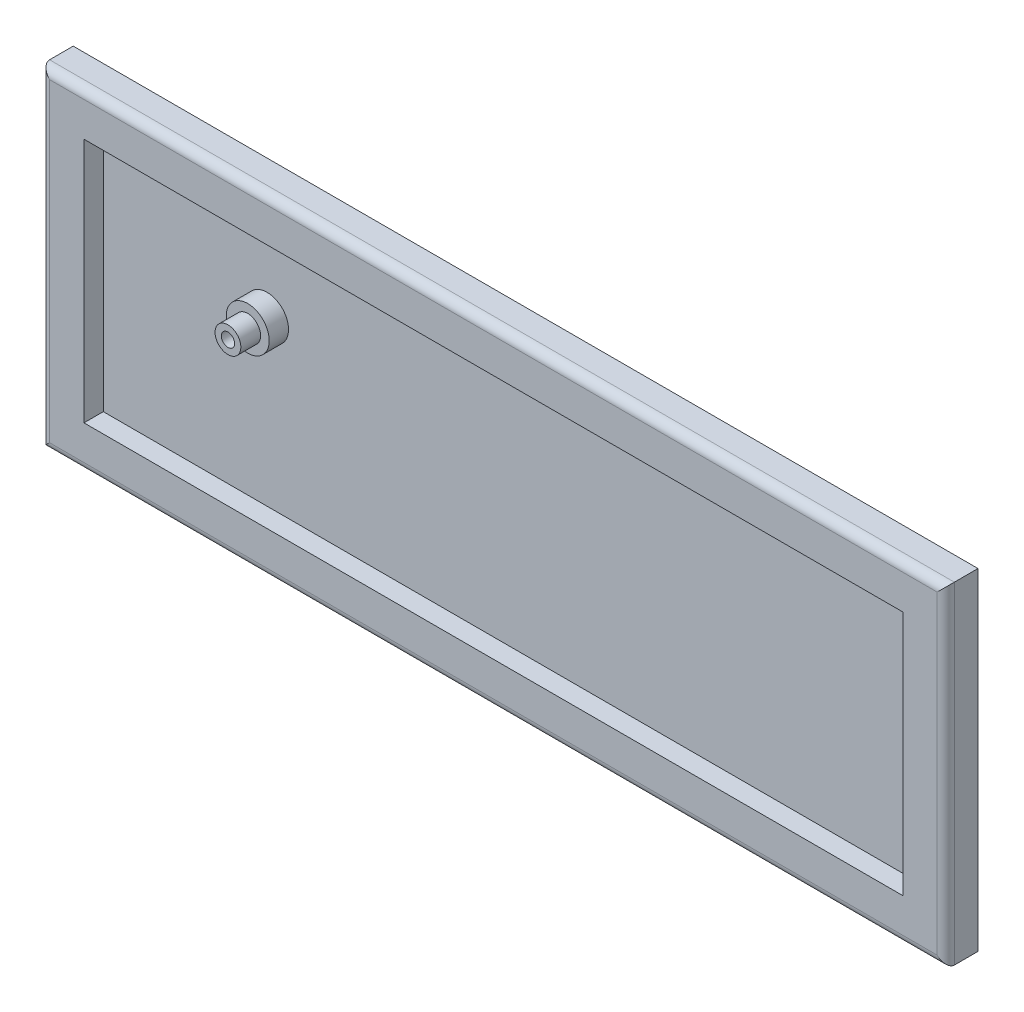
ISO-10303-21;
HEADER;
FILE_DESCRIPTION(('STEP AP214'),'2;1');
FILE_NAME('part.step','',(''),(''),'','','');
FILE_SCHEMA(('AUTOMOTIVE_DESIGN { 1 0 10303 214 1 1 1 1 }'));
ENDSEC;
DATA;
#1=APPLICATION_CONTEXT('core data for automotive mechanical design processes');
#2=APPLICATION_PROTOCOL_DEFINITION('international standard','automotive_design',2000,#1);
#3=PRODUCT_CONTEXT('',#1,'mechanical');
#4=PRODUCT('Part','Part','',(#3));
#5=PRODUCT_RELATED_PRODUCT_CATEGORY('part','',(#4));
#6=PRODUCT_DEFINITION_FORMATION('','',#4);
#7=PRODUCT_DEFINITION_CONTEXT('part definition',#1,'design');
#8=PRODUCT_DEFINITION('design','',#6,#7);
#9=PRODUCT_DEFINITION_SHAPE('','',#8);
#10=(LENGTH_UNIT() NAMED_UNIT(*) SI_UNIT(.MILLI.,.METRE.));
#11=(NAMED_UNIT(*) PLANE_ANGLE_UNIT() SI_UNIT($,.RADIAN.));
#12=(NAMED_UNIT(*) SI_UNIT($,.STERADIAN.) SOLID_ANGLE_UNIT());
#13=UNCERTAINTY_MEASURE_WITH_UNIT(LENGTH_MEASURE(1.E-05),#10,'distance_accuracy_value','');
#14=(GEOMETRIC_REPRESENTATION_CONTEXT(3) GLOBAL_UNCERTAINTY_ASSIGNED_CONTEXT((#13)) GLOBAL_UNIT_ASSIGNED_CONTEXT((#10,
#11,#12)) REPRESENTATION_CONTEXT('',''));
#15=CARTESIAN_POINT('',(0.,0.,0.));
#16=DIRECTION('',(0.,0.,1.));
#17=DIRECTION('',(1.,0.,0.));
#18=AXIS2_PLACEMENT_3D('',#15,#16,#17);
#19=CARTESIAN_POINT('',(-9.90490769999997,-9.74318500000001,34.5));
#20=DIRECTION('',(1.,0.,0.));
#21=DIRECTION('',(0.,0.,-1.));
#22=AXIS2_PLACEMENT_3D('',#19,#20,#21);
#23=PLANE('',#22);
#24=DIRECTION('',(0.,0.,-1.));
#25=VECTOR('',#24,1.);
#26=CARTESIAN_POINT('',(-9.90490769999997,-9.74318500000001,34.5));
#27=LINE('',#26,#25);
#28=CARTESIAN_POINT('',(-9.90490769999997,-9.74318500000001,5.50000000000001));
#29=VERTEX_POINT('',#28);
#30=CARTESIAN_POINT('',(-9.90490769999997,-9.74318500000001,0.));
#31=VERTEX_POINT('',#30);
#32=EDGE_CURVE('E204',#29,#31,#27,.T.);
#33=ORIENTED_EDGE('',*,*,#32,.F.);
#34=DIRECTION('',(0.,-1.,0.));
#35=VECTOR('',#34,1.);
#36=CARTESIAN_POINT('',(-9.90490769999997,67.407315,5.5));
#37=LINE('',#36,#35);
#38=CARTESIAN_POINT('',(-9.90490769999997,67.407315,5.50000000000001));
#39=VERTEX_POINT('',#38);
#40=EDGE_CURVE('E12',#29,#39,#37,.F.);
#41=ORIENTED_EDGE('',*,*,#40,.T.);
#42=DIRECTION('',(0.,0.,-1.));
#43=VECTOR('',#42,1.);
#44=CARTESIAN_POINT('',(-9.90490769999997,67.407315,34.5));
#45=LINE('',#44,#43);
#46=CARTESIAN_POINT('',(-9.90490769999997,67.407315,0.));
#47=VERTEX_POINT('',#46);
#48=EDGE_CURVE('E192',#39,#47,#45,.T.);
#49=ORIENTED_EDGE('',*,*,#48,.T.);
#50=DIRECTION('',(0.,-1.,0.));
#51=VECTOR('',#50,1.);
#52=CARTESIAN_POINT('',(-9.90490769999997,-9.74318500000001,0.));
#53=LINE('',#52,#51);
#54=EDGE_CURVE('E197',#47,#31,#53,.T.);
#55=ORIENTED_EDGE('',*,*,#54,.T.);
#56=EDGE_LOOP('',(#33,#41,#49,#55));
#57=FACE_BOUND('',#56,.T.);
#58=ADVANCED_FACE('F42',(#57),#23,.F.);
#59=CARTESIAN_POINT('',(200.5959923,-9.74318499999999,34.5));
#60=DIRECTION('',(0.,1.,0.));
#61=DIRECTION('',(-1.,0.,0.));
#62=AXIS2_PLACEMENT_3D('',#59,#60,#61);
#63=PLANE('',#62);
#64=DIRECTION('',(0.,0.,-1.));
#65=VECTOR('',#64,1.);
#66=CARTESIAN_POINT('',(200.5959923,-9.74318499999999,34.5));
#67=LINE('',#66,#65);
#68=CARTESIAN_POINT('',(200.5959923,-9.74318499999999,5.50000000000001));
#69=VERTEX_POINT('',#68);
#70=CARTESIAN_POINT('',(200.5959923,-9.74318499999999,0.));
#71=VERTEX_POINT('',#70);
#72=EDGE_CURVE('E234',#69,#71,#67,.T.);
#73=ORIENTED_EDGE('',*,*,#72,.F.);
#74=DIRECTION('',(1.,0.,0.));
#75=VECTOR('',#74,1.);
#76=CARTESIAN_POINT('',(-9.90490769999997,-9.74318500000001,5.5));
#77=LINE('',#76,#75);
#78=EDGE_CURVE('E52',#69,#29,#77,.F.);
#79=ORIENTED_EDGE('',*,*,#78,.T.);
#80=ORIENTED_EDGE('',*,*,#32,.T.);
#81=DIRECTION('',(1.,0.,0.));
#82=VECTOR('',#81,1.);
#83=CARTESIAN_POINT('',(200.5959923,-9.74318499999999,0.));
#84=LINE('',#83,#82);
#85=EDGE_CURVE('E233',#31,#71,#84,.T.);
#86=ORIENTED_EDGE('',*,*,#85,.T.);
#87=EDGE_LOOP('',(#73,#79,#80,#86));
#88=FACE_BOUND('',#87,.T.);
#89=ADVANCED_FACE('F305',(#88),#63,.F.);
#90=CARTESIAN_POINT('',(200.5959923,-9.74318499999999,34.5));
#91=DIRECTION('',(-1.,0.,0.));
#92=DIRECTION('',(0.,0.,1.));
#93=AXIS2_PLACEMENT_3D('',#90,#91,#92);
#94=PLANE('',#93);
#95=DIRECTION('',(0.,0.,-1.));
#96=VECTOR('',#95,1.);
#97=CARTESIAN_POINT('',(200.5959923,67.407315,34.5));
#98=LINE('',#97,#96);
#99=CARTESIAN_POINT('',(200.5959923,67.407315,5.50000000000001));
#100=VERTEX_POINT('',#99);
#101=CARTESIAN_POINT('',(200.5959923,67.407315,0.));
#102=VERTEX_POINT('',#101);
#103=EDGE_CURVE('E208',#100,#102,#98,.T.);
#104=ORIENTED_EDGE('',*,*,#103,.F.);
#105=DIRECTION('',(0.,1.,0.));
#106=VECTOR('',#105,1.);
#107=CARTESIAN_POINT('',(200.5959923,-9.74318499999999,5.5));
#108=LINE('',#107,#106);
#109=EDGE_CURVE('E67',#100,#69,#108,.F.);
#110=ORIENTED_EDGE('',*,*,#109,.T.);
#111=ORIENTED_EDGE('',*,*,#72,.T.);
#112=DIRECTION('',(0.,1.,0.));
#113=VECTOR('',#112,1.);
#114=CARTESIAN_POINT('',(200.5959923,-9.74318499999999,0.));
#115=LINE('',#114,#113);
#116=EDGE_CURVE('E236',#71,#102,#115,.T.);
#117=ORIENTED_EDGE('',*,*,#116,.T.);
#118=EDGE_LOOP('',(#104,#110,#111,#117));
#119=FACE_BOUND('',#118,.T.);
#120=ADVANCED_FACE('F286',(#119),#94,.F.);
#121=CARTESIAN_POINT('',(200.5959923,67.407315,34.5));
#122=DIRECTION('',(0.,-1.,0.));
#123=DIRECTION('',(1.,0.,0.));
#124=AXIS2_PLACEMENT_3D('',#121,#122,#123);
#125=PLANE('',#124);
#126=ORIENTED_EDGE('',*,*,#48,.F.);
#127=DIRECTION('',(-1.,0.,0.));
#128=VECTOR('',#127,1.);
#129=CARTESIAN_POINT('',(200.5959923,67.407315,5.5));
#130=LINE('',#129,#128);
#131=EDGE_CURVE('E170',#39,#100,#130,.F.);
#132=ORIENTED_EDGE('',*,*,#131,.T.);
#133=ORIENTED_EDGE('',*,*,#103,.T.);
#134=DIRECTION('',(-1.,0.,0.));
#135=VECTOR('',#134,1.);
#136=CARTESIAN_POINT('',(200.5959923,67.407315,0.));
#137=LINE('',#136,#135);
#138=EDGE_CURVE('E226',#102,#47,#137,.T.);
#139=ORIENTED_EDGE('',*,*,#138,.T.);
#140=EDGE_LOOP('',(#126,#132,#133,#139));
#141=FACE_BOUND('',#140,.T.);
#142=ADVANCED_FACE('F284',(#141),#125,.F.);
#143=CARTESIAN_POINT('',(38.19575,38.357,12.1));
#144=DIRECTION('',(0.,0.,1.));
#145=DIRECTION('',(1.,0.,0.));
#146=AXIS2_PLACEMENT_3D('',#143,#144,#145);
#147=PLANE('',#146);
#148=CARTESIAN_POINT('',(38.19575,38.357,12.1));
#149=DIRECTION('',(0.,0.,1.));
#150=DIRECTION('',(1.,0.,0.));
#151=AXIS2_PLACEMENT_3D('',#148,#149,#150);
#152=CIRCLE('',#151,1.55);
#153=CARTESIAN_POINT('',(39.74575,38.357,12.1));
#154=VERTEX_POINT('',#153);
#155=EDGE_CURVE('E231',#154,#154,#152,.T.);
#156=ORIENTED_EDGE('',*,*,#155,.F.);
#157=EDGE_LOOP('',(#156));
#158=FACE_BOUND('',#157,.T.);
#159=CARTESIAN_POINT('',(38.19575,38.357,12.1));
#160=DIRECTION('',(0.,0.,1.));
#161=DIRECTION('',(1.,0.,0.));
#162=AXIS2_PLACEMENT_3D('',#159,#160,#161);
#163=CIRCLE('',#162,3.);
#164=CARTESIAN_POINT('',(41.19575,38.357,12.1));
#165=VERTEX_POINT('',#164);
#166=EDGE_CURVE('E221',#165,#165,#163,.T.);
#167=ORIENTED_EDGE('',*,*,#166,.T.);
#168=EDGE_LOOP('',(#167));
#169=FACE_BOUND('',#168,.T.);
#170=ADVANCED_FACE('F364',(#158,#169),#147,.T.);
#171=CARTESIAN_POINT('',(0.,0.,0.));
#172=DIRECTION('',(0.,0.,1.));
#173=DIRECTION('',(1.,0.,0.));
#174=AXIS2_PLACEMENT_3D('',#171,#172,#173);
#175=PLANE('',#174);
#176=CARTESIAN_POINT('',(38.19575,38.357,0.));
#177=DIRECTION('',(0.,0.,1.));
#178=DIRECTION('',(1.,0.,0.));
#179=AXIS2_PLACEMENT_3D('',#176,#177,#178);
#180=CIRCLE('',#179,2.1);
#181=CARTESIAN_POINT('',(36.09575,38.357,0.));
#182=VERTEX_POINT('',#181);
#183=EDGE_CURVE('E225',#182,#182,#180,.T.);
#184=ORIENTED_EDGE('',*,*,#183,.T.);
#185=EDGE_LOOP('',(#184));
#186=FACE_BOUND('',#185,.T.);
#187=ORIENTED_EDGE('',*,*,#54,.F.);
#188=ORIENTED_EDGE('',*,*,#138,.F.);
#189=ORIENTED_EDGE('',*,*,#116,.F.);
#190=ORIENTED_EDGE('',*,*,#85,.F.);
#191=EDGE_LOOP('',(#187,#188,#189,#190));
#192=FACE_BOUND('',#191,.T.);
#193=ADVANCED_FACE('F288',(#186,#192),#175,.F.);
#194=CARTESIAN_POINT('',(38.19575,38.357,7.6));
#195=DIRECTION('',(0.,0.,-1.));
#196=DIRECTION('',(-1.,0.,0.));
#197=AXIS2_PLACEMENT_3D('',#194,#195,#196);
#198=CYLINDRICAL_SURFACE('',#197,2.1);
#199=CARTESIAN_POINT('',(38.19575,38.357,3.));
#200=DIRECTION('',(0.,0.,1.));
#201=DIRECTION('',(1.,0.,0.));
#202=AXIS2_PLACEMENT_3D('',#199,#200,#201);
#203=CIRCLE('',#202,2.1);
#204=CARTESIAN_POINT('',(36.09575,38.357,3.));
#205=VERTEX_POINT('',#204);
#206=EDGE_CURVE('E268',#205,#205,#203,.F.);
#207=CARTESIAN_POINT('',(36.09575,38.357,3.));
#208=CARTESIAN_POINT('',(36.09575,38.357,2.96875));
#209=CARTESIAN_POINT('',(36.09575,38.357,2.9375));
#210=CARTESIAN_POINT('',(36.09575,38.357,2.875));
#211=CARTESIAN_POINT('',(36.09575,38.357,2.84375));
#212=CARTESIAN_POINT('',(36.09575,38.357,2.78125));
#213=CARTESIAN_POINT('',(36.09575,38.357,2.75));
#214=CARTESIAN_POINT('',(36.09575,38.357,2.6875));
#215=CARTESIAN_POINT('',(36.09575,38.357,2.65625));
#216=CARTESIAN_POINT('',(36.09575,38.357,2.59375));
#217=CARTESIAN_POINT('',(36.09575,38.357,2.5625));
#218=CARTESIAN_POINT('',(36.09575,38.357,2.5));
#219=CARTESIAN_POINT('',(36.09575,38.357,2.46875));
#220=CARTESIAN_POINT('',(36.09575,38.357,2.40625));
#221=CARTESIAN_POINT('',(36.09575,38.357,2.375));
#222=CARTESIAN_POINT('',(36.09575,38.357,2.3125));
#223=CARTESIAN_POINT('',(36.09575,38.357,2.28125));
#224=CARTESIAN_POINT('',(36.09575,38.357,2.21875));
#225=CARTESIAN_POINT('',(36.09575,38.357,2.1875));
#226=CARTESIAN_POINT('',(36.09575,38.357,2.125));
#227=CARTESIAN_POINT('',(36.09575,38.357,2.09375));
#228=CARTESIAN_POINT('',(36.09575,38.357,2.03125));
#229=CARTESIAN_POINT('',(36.09575,38.357,2.));
#230=CARTESIAN_POINT('',(36.09575,38.357,1.9375));
#231=CARTESIAN_POINT('',(36.09575,38.357,1.90625));
#232=CARTESIAN_POINT('',(36.09575,38.357,1.84375));
#233=CARTESIAN_POINT('',(36.09575,38.357,1.8125));
#234=CARTESIAN_POINT('',(36.09575,38.357,1.75));
#235=CARTESIAN_POINT('',(36.09575,38.357,1.71875));
#236=CARTESIAN_POINT('',(36.09575,38.357,1.65625));
#237=CARTESIAN_POINT('',(36.09575,38.357,1.625));
#238=CARTESIAN_POINT('',(36.09575,38.357,1.5625));
#239=CARTESIAN_POINT('',(36.09575,38.357,1.53125));
#240=CARTESIAN_POINT('',(36.09575,38.357,1.46875));
#241=CARTESIAN_POINT('',(36.09575,38.357,1.4375));
#242=CARTESIAN_POINT('',(36.09575,38.357,1.375));
#243=CARTESIAN_POINT('',(36.09575,38.357,1.34375));
#244=CARTESIAN_POINT('',(36.09575,38.357,1.28125));
#245=CARTESIAN_POINT('',(36.09575,38.357,1.25));
#246=CARTESIAN_POINT('',(36.09575,38.357,1.1875));
#247=CARTESIAN_POINT('',(36.09575,38.357,1.15625));
#248=CARTESIAN_POINT('',(36.09575,38.357,1.09375));
#249=CARTESIAN_POINT('',(36.09575,38.357,1.0625));
#250=CARTESIAN_POINT('',(36.09575,38.357,0.999999999999999));
#251=CARTESIAN_POINT('',(36.09575,38.357,0.96875));
#252=CARTESIAN_POINT('',(36.09575,38.357,0.90625));
#253=CARTESIAN_POINT('',(36.09575,38.357,0.875));
#254=CARTESIAN_POINT('',(36.09575,38.357,0.8125));
#255=CARTESIAN_POINT('',(36.09575,38.357,0.78125));
#256=CARTESIAN_POINT('',(36.09575,38.357,0.71875));
#257=CARTESIAN_POINT('',(36.09575,38.357,0.6875));
#258=CARTESIAN_POINT('',(36.09575,38.357,0.625));
#259=CARTESIAN_POINT('',(36.09575,38.357,0.59375));
#260=CARTESIAN_POINT('',(36.09575,38.357,0.53125));
#261=CARTESIAN_POINT('',(36.09575,38.357,0.5));
#262=CARTESIAN_POINT('',(36.09575,38.357,0.4375));
#263=CARTESIAN_POINT('',(36.09575,38.357,0.40625));
#264=CARTESIAN_POINT('',(36.09575,38.357,0.34375));
#265=CARTESIAN_POINT('',(36.09575,38.357,0.3125));
#266=CARTESIAN_POINT('',(36.09575,38.357,0.25));
#267=CARTESIAN_POINT('',(36.09575,38.357,0.21875));
#268=CARTESIAN_POINT('',(36.09575,38.357,0.15625));
#269=CARTESIAN_POINT('',(36.09575,38.357,0.125));
#270=CARTESIAN_POINT('',(36.09575,38.357,0.0625000000000001));
#271=CARTESIAN_POINT('',(36.09575,38.357,0.03125));
#272=CARTESIAN_POINT('',(36.09575,38.357,0.));
#273=B_SPLINE_CURVE_WITH_KNOTS('',3,(#207,#208,#209,#210,#211,#212,#213,#214,#215,#216,#217,
#218,#219,#220,#221,#222,#223,#224,#225,#226,#227,#228,#229,#230,#231,#232,#233,#234,#235,#236,
#237,#238,#239,#240,#241,#242,#243,#244,#245,#246,#247,#248,#249,#250,#251,#252,#253,#254,#255,
#256,#257,#258,#259,#260,#261,#262,#263,#264,#265,#266,#267,#268,#269,#270,#271,#272),
.UNSPECIFIED.,.F.,.F.,(4,2,2,2,2,2,2,2,2,2,2,2,2,2,2,2,2,2,2,2,2,2,2,2,2,2,2,2,2,2,2,2,4),(0.,
0.0937500000000001,0.1875,0.28125,0.375,0.46875,0.5625,0.65625,0.75,0.84375,0.9375,1.03125,
1.125,1.21875,1.3125,1.40625,1.5,1.59375,1.6875,1.78125,1.875,1.96875,2.0625,2.15625,2.25,
2.34375,2.4375,2.53125,2.625,2.71875,2.8125,2.90625,3.),.UNSPECIFIED.);
#274=EDGE_CURVE('BSEAM461',#205,#182,#273,.T.);
#275=ORIENTED_EDGE('',*,*,#206,.F.);
#276=ORIENTED_EDGE('',*,*,#183,.F.);
#277=ORIENTED_EDGE('',*,*,#274,.T.);
#278=ORIENTED_EDGE('',*,*,#274,.F.);
#279=EDGE_LOOP('',(#275,#277,#276,#278));
#280=FACE_BOUND('',#279,.T.);
#281=ADVANCED_FACE('F461',(#280),#198,.F.);
#282=CARTESIAN_POINT('',(38.19575,38.357,3.));
#283=DIRECTION('',(0.,0.,1.));
#284=DIRECTION('',(1.,0.,0.));
#285=AXIS2_PLACEMENT_3D('',#282,#283,#284);
#286=PLANE('',#285);
#287=CARTESIAN_POINT('',(38.19575,38.357,3.));
#288=DIRECTION('',(0.,0.,1.));
#289=DIRECTION('',(1.,0.,0.));
#290=AXIS2_PLACEMENT_3D('',#287,#288,#289);
#291=CIRCLE('',#290,1.55);
#292=CARTESIAN_POINT('',(39.74575,38.357,3.));
#293=VERTEX_POINT('',#292);
#294=EDGE_CURVE('E262',#293,#293,#291,.T.);
#295=ORIENTED_EDGE('',*,*,#294,.T.);
#296=EDGE_LOOP('',(#295));
#297=FACE_BOUND('',#296,.T.);
#298=ORIENTED_EDGE('',*,*,#206,.T.);
#299=EDGE_LOOP('',(#298));
#300=FACE_BOUND('',#299,.T.);
#301=ADVANCED_FACE('F451',(#297,#300),#286,.F.);
#302=CARTESIAN_POINT('',(38.19575,38.357,3.));
#303=DIRECTION('',(0.,0.,1.));
#304=DIRECTION('',(1.,0.,0.));
#305=AXIS2_PLACEMENT_3D('',#302,#303,#304);
#306=CYLINDRICAL_SURFACE('',#305,1.55);
#307=ORIENTED_EDGE('',*,*,#294,.F.);
#308=EDGE_LOOP('',(#307));
#309=FACE_BOUND('',#308,.T.);
#310=ORIENTED_EDGE('',*,*,#155,.T.);
#311=EDGE_LOOP('',(#310));
#312=FACE_BOUND('',#311,.T.);
#313=ADVANCED_FACE('F442',(#309,#312),#306,.F.);
#314=CARTESIAN_POINT('',(38.19575,38.357,7.5));
#315=DIRECTION('',(0.,0.,1.));
#316=DIRECTION('',(1.,0.,0.));
#317=AXIS2_PLACEMENT_3D('',#314,#315,#316);
#318=CYLINDRICAL_SURFACE('',#317,3.);
#319=CARTESIAN_POINT('',(38.19575,38.357,7.5));
#320=DIRECTION('',(0.,0.,1.));
#321=DIRECTION('',(1.,0.,0.));
#322=AXIS2_PLACEMENT_3D('',#319,#320,#321);
#323=CIRCLE('',#322,3.);
#324=CARTESIAN_POINT('',(41.19575,38.357,7.5));
#325=VERTEX_POINT('',#324);
#326=EDGE_CURVE('E227',#325,#325,#323,.T.);
#327=ORIENTED_EDGE('',*,*,#326,.T.);
#328=EDGE_LOOP('',(#327));
#329=FACE_BOUND('',#328,.T.);
#330=ORIENTED_EDGE('',*,*,#166,.F.);
#331=EDGE_LOOP('',(#330));
#332=FACE_BOUND('',#331,.T.);
#333=ADVANCED_FACE('F434',(#329,#332),#318,.T.);
#334=CARTESIAN_POINT('',(0.,0.,7.5));
#335=DIRECTION('',(0.,0.,1.));
#336=DIRECTION('',(1.,0.,0.));
#337=AXIS2_PLACEMENT_3D('',#334,#335,#336);
#338=PLANE('',#337);
#339=ORIENTED_EDGE('',*,*,#326,.F.);
#340=EDGE_LOOP('',(#339));
#341=FACE_BOUND('',#340,.T.);
#342=CARTESIAN_POINT('',(38.19575,38.357,7.5));
#343=DIRECTION('',(0.,0.,1.));
#344=DIRECTION('',(1.,0.,0.));
#345=AXIS2_PLACEMENT_3D('',#342,#343,#344);
#346=CIRCLE('',#345,5.);
#347=CARTESIAN_POINT('',(43.19575,38.357,7.5));
#348=VERTEX_POINT('',#347);
#349=EDGE_CURVE('E142',#348,#348,#346,.T.);
#350=ORIENTED_EDGE('',*,*,#349,.T.);
#351=EDGE_LOOP('',(#350));
#352=FACE_BOUND('',#351,.T.);
#353=ADVANCED_FACE('F316',(#341,#352),#338,.T.);
#354=CARTESIAN_POINT('',(200.5959923,57.407315,34.5));
#355=DIRECTION('',(0.,-1.,0.));
#356=DIRECTION('',(1.,0.,0.));
#357=AXIS2_PLACEMENT_3D('',#354,#355,#356);
#358=PLANE('',#357);
#359=DIRECTION('',(0.,0.,-1.));
#360=VECTOR('',#359,1.);
#361=CARTESIAN_POINT('',(190.5959923,57.407315,34.5));
#362=LINE('',#361,#360);
#363=CARTESIAN_POINT('',(190.5959923,57.407315,7.5));
#364=VERTEX_POINT('',#363);
#365=CARTESIAN_POINT('',(190.5959923,57.407315,3.));
#366=VERTEX_POINT('',#365);
#367=EDGE_CURVE('E140',#364,#366,#362,.T.);
#368=ORIENTED_EDGE('',*,*,#367,.F.);
#369=DIRECTION('',(-1.,0.,0.));
#370=VECTOR('',#369,1.);
#371=CARTESIAN_POINT('',(200.5959923,57.407315,7.5));
#372=LINE('',#371,#370);
#373=CARTESIAN_POINT('',(0.095092300000035,57.407315,7.5));
#374=VERTEX_POINT('',#373);
#375=EDGE_CURVE('E123',#364,#374,#372,.T.);
#376=ORIENTED_EDGE('',*,*,#375,.T.);
#377=DIRECTION('',(0.,0.,-1.));
#378=VECTOR('',#377,1.);
#379=CARTESIAN_POINT('',(0.095092300000035,57.407315,34.5));
#380=LINE('',#379,#378);
#381=CARTESIAN_POINT('',(0.095092300000035,57.407315,3.));
#382=VERTEX_POINT('',#381);
#383=EDGE_CURVE('E138',#374,#382,#380,.T.);
#384=ORIENTED_EDGE('',*,*,#383,.T.);
#385=DIRECTION('',(-1.,0.,0.));
#386=VECTOR('',#385,1.);
#387=CARTESIAN_POINT('',(200.5959923,57.407315,3.));
#388=LINE('',#387,#386);
#389=EDGE_CURVE('E247',#366,#382,#388,.T.);
#390=ORIENTED_EDGE('',*,*,#389,.F.);
#391=EDGE_LOOP('',(#368,#376,#384,#390));
#392=FACE_BOUND('',#391,.T.);
#393=ADVANCED_FACE('F136',(#392),#358,.T.);
#394=CARTESIAN_POINT('',(190.5959923,-9.74318499999999,34.5));
#395=DIRECTION('',(-1.,0.,0.));
#396=DIRECTION('',(0.,0.,1.));
#397=AXIS2_PLACEMENT_3D('',#394,#395,#396);
#398=PLANE('',#397);
#399=DIRECTION('',(0.,0.,-1.));
#400=VECTOR('',#399,1.);
#401=CARTESIAN_POINT('',(190.5959923,0.256815000000013,34.5));
#402=LINE('',#401,#400);
#403=CARTESIAN_POINT('',(190.5959923,0.256815000000013,7.5));
#404=VERTEX_POINT('',#403);
#405=CARTESIAN_POINT('',(190.5959923,0.256815000000013,3.));
#406=VERTEX_POINT('',#405);
#407=EDGE_CURVE('E132',#404,#406,#402,.T.);
#408=ORIENTED_EDGE('',*,*,#407,.F.);
#409=DIRECTION('',(0.,1.,0.));
#410=VECTOR('',#409,1.);
#411=CARTESIAN_POINT('',(190.5959923,-9.74318499999999,7.5));
#412=LINE('',#411,#410);
#413=EDGE_CURVE('E149',#404,#364,#412,.T.);
#414=ORIENTED_EDGE('',*,*,#413,.T.);
#415=ORIENTED_EDGE('',*,*,#367,.T.);
#416=DIRECTION('',(0.,1.,0.));
#417=VECTOR('',#416,1.);
#418=CARTESIAN_POINT('',(190.5959923,-9.74318499999999,3.));
#419=LINE('',#418,#417);
#420=EDGE_CURVE('E250',#406,#366,#419,.T.);
#421=ORIENTED_EDGE('',*,*,#420,.F.);
#422=EDGE_LOOP('',(#408,#414,#415,#421));
#423=FACE_BOUND('',#422,.T.);
#424=ADVANCED_FACE('F315',(#423),#398,.T.);
#425=CARTESIAN_POINT('',(200.5959923,0.256815000000014,34.5));
#426=DIRECTION('',(0.,1.,0.));
#427=DIRECTION('',(-1.,0.,0.));
#428=AXIS2_PLACEMENT_3D('',#425,#426,#427);
#429=PLANE('',#428);
#430=DIRECTION('',(0.,0.,-1.));
#431=VECTOR('',#430,1.);
#432=CARTESIAN_POINT('',(0.0950923000000437,0.25681499999999,34.5));
#433=LINE('',#432,#431);
#434=CARTESIAN_POINT('',(0.0950923000000437,0.25681499999999,7.5));
#435=VERTEX_POINT('',#434);
#436=CARTESIAN_POINT('',(0.095092300000035,0.25681499999999,3.));
#437=VERTEX_POINT('',#436);
#438=EDGE_CURVE('E131',#435,#437,#433,.T.);
#439=ORIENTED_EDGE('',*,*,#438,.F.);
#440=DIRECTION('',(1.,0.,0.));
#441=VECTOR('',#440,1.);
#442=CARTESIAN_POINT('',(200.5959923,0.256815000000014,7.5));
#443=LINE('',#442,#441);
#444=EDGE_CURVE('E126',#435,#404,#443,.T.);
#445=ORIENTED_EDGE('',*,*,#444,.T.);
#446=ORIENTED_EDGE('',*,*,#407,.T.);
#447=DIRECTION('',(1.,0.,0.));
#448=VECTOR('',#447,1.);
#449=CARTESIAN_POINT('',(200.5959923,0.256815000000014,3.));
#450=LINE('',#449,#448);
#451=EDGE_CURVE('E254',#437,#406,#450,.T.);
#452=ORIENTED_EDGE('',*,*,#451,.F.);
#453=EDGE_LOOP('',(#439,#445,#446,#452));
#454=FACE_BOUND('',#453,.T.);
#455=ADVANCED_FACE('F319',(#454),#429,.T.);
#456=CARTESIAN_POINT('',(0.095092300000035,-9.74318500000001,34.5));
#457=DIRECTION('',(1.,0.,0.));
#458=DIRECTION('',(0.,0.,-1.));
#459=AXIS2_PLACEMENT_3D('',#456,#457,#458);
#460=PLANE('',#459);
#461=ORIENTED_EDGE('',*,*,#383,.F.);
#462=DIRECTION('',(0.,-1.,0.));
#463=VECTOR('',#462,1.);
#464=CARTESIAN_POINT('',(0.095092300000035,-9.74318500000001,7.5));
#465=LINE('',#464,#463);
#466=EDGE_CURVE('E120',#374,#435,#465,.T.);
#467=ORIENTED_EDGE('',*,*,#466,.T.);
#468=ORIENTED_EDGE('',*,*,#438,.T.);
#469=DIRECTION('',(0.,-1.,0.));
#470=VECTOR('',#469,1.);
#471=CARTESIAN_POINT('',(0.095092300000035,-9.74318500000001,3.));
#472=LINE('',#471,#470);
#473=EDGE_CURVE('E147',#382,#437,#472,.T.);
#474=ORIENTED_EDGE('',*,*,#473,.F.);
#475=EDGE_LOOP('',(#461,#467,#468,#474));
#476=FACE_BOUND('',#475,.T.);
#477=ADVANCED_FACE('F145',(#476),#460,.T.);
#478=CARTESIAN_POINT('',(0.,0.,3.));
#479=DIRECTION('',(0.,0.,1.));
#480=DIRECTION('',(1.,0.,0.));
#481=AXIS2_PLACEMENT_3D('',#478,#479,#480);
#482=PLANE('',#481);
#483=CARTESIAN_POINT('',(38.19575,38.357,3.));
#484=DIRECTION('',(0.,0.,1.));
#485=DIRECTION('',(1.,0.,0.));
#486=AXIS2_PLACEMENT_3D('',#483,#484,#485);
#487=CIRCLE('',#486,5.);
#488=CARTESIAN_POINT('',(43.19575,38.357,3.));
#489=VERTEX_POINT('',#488);
#490=EDGE_CURVE('E160',#489,#489,#487,.T.);
#491=ORIENTED_EDGE('',*,*,#490,.F.);
#492=EDGE_LOOP('',(#491));
#493=FACE_BOUND('',#492,.T.);
#494=ORIENTED_EDGE('',*,*,#473,.T.);
#495=ORIENTED_EDGE('',*,*,#451,.T.);
#496=ORIENTED_EDGE('',*,*,#420,.T.);
#497=ORIENTED_EDGE('',*,*,#389,.T.);
#498=EDGE_LOOP('',(#494,#495,#496,#497));
#499=FACE_BOUND('',#498,.T.);
#500=ADVANCED_FACE('F325',(#493,#499),#482,.T.);
#501=CARTESIAN_POINT('',(38.19575,38.357,12.1));
#502=DIRECTION('',(0.,0.,-1.));
#503=DIRECTION('',(-1.,0.,0.));
#504=AXIS2_PLACEMENT_3D('',#501,#502,#503);
#505=CYLINDRICAL_SURFACE('',#504,5.);
#506=ORIENTED_EDGE('',*,*,#490,.T.);
#507=EDGE_LOOP('',(#506));
#508=FACE_BOUND('',#507,.T.);
#509=ORIENTED_EDGE('',*,*,#349,.F.);
#510=EDGE_LOOP('',(#509));
#511=FACE_BOUND('',#510,.T.);
#512=ADVANCED_FACE('F352',(#508,#511),#505,.T.);
#513=DIRECTION('',(0.,1.,0.));
#514=VECTOR('',#513,1.);
#515=CARTESIAN_POINT('',(198.5959923,67.407315,7.5));
#516=LINE('',#515,#514);
#517=CARTESIAN_POINT('',(198.5959923,-7.74318499999999,7.5));
#518=VERTEX_POINT('',#517);
#519=CARTESIAN_POINT('',(198.5959923,65.407315,7.5));
#520=VERTEX_POINT('',#519);
#521=EDGE_CURVE('E163',#518,#520,#516,.T.);
#522=ORIENTED_EDGE('',*,*,#521,.T.);
#523=DIRECTION('',(-1.,0.,0.));
#524=VECTOR('',#523,1.);
#525=CARTESIAN_POINT('',(-9.90490769999997,65.407315,7.5));
#526=LINE('',#525,#524);
#527=CARTESIAN_POINT('',(-7.90490769999997,65.407315,7.5));
#528=VERTEX_POINT('',#527);
#529=EDGE_CURVE('E166',#520,#528,#526,.T.);
#530=ORIENTED_EDGE('',*,*,#529,.T.);
#531=DIRECTION('',(0.,-1.,0.));
#532=VECTOR('',#531,1.);
#533=CARTESIAN_POINT('',(-7.90490769999997,-9.74318500000001,7.5));
#534=LINE('',#533,#532);
#535=CARTESIAN_POINT('',(-7.90490769999997,-7.74318500000001,7.5));
#536=VERTEX_POINT('',#535);
#537=EDGE_CURVE('E156',#528,#536,#534,.T.);
#538=ORIENTED_EDGE('',*,*,#537,.T.);
#539=DIRECTION('',(1.,0.,0.));
#540=VECTOR('',#539,1.);
#541=CARTESIAN_POINT('',(200.5959923,-7.74318499999999,7.5));
#542=LINE('',#541,#540);
#543=EDGE_CURVE('E159',#536,#518,#542,.T.);
#544=ORIENTED_EDGE('',*,*,#543,.T.);
#545=EDGE_LOOP('',(#522,#530,#538,#544));
#546=FACE_BOUND('',#545,.T.);
#547=ORIENTED_EDGE('',*,*,#375,.F.);
#548=ORIENTED_EDGE('',*,*,#413,.F.);
#549=ORIENTED_EDGE('',*,*,#444,.F.);
#550=ORIENTED_EDGE('',*,*,#466,.F.);
#551=EDGE_LOOP('',(#547,#548,#549,#550));
#552=FACE_BOUND('',#551,.T.);
#553=ADVANCED_FACE('F122',(#546,#552),#338,.T.);
#554=CARTESIAN_POINT('',(0.,-7.74318500000001,5.5));
#555=DIRECTION('',(-1.,0.,0.));
#556=DIRECTION('',(0.,-1.,0.));
#557=AXIS2_PLACEMENT_3D('',#554,#555,#556);
#558=CYLINDRICAL_SURFACE('',#557,2.);
#559=CARTESIAN_POINT('',(-7.90490769999997,-7.74318500000001,5.5));
#560=DIRECTION('',(-0.707106781186548,0.707106781186547,0.));
#561=DIRECTION('',(0.707106781186547,0.707106781186548,0.));
#562=AXIS2_PLACEMENT_3D('',#559,#560,#561);
#563=ELLIPSE('',#562,2.82842712474619,2.);
#564=EDGE_CURVE('E183',#29,#536,#563,.T.);
#565=ORIENTED_EDGE('',*,*,#564,.F.);
#566=ORIENTED_EDGE('',*,*,#78,.F.);
#567=CARTESIAN_POINT('',(198.5959923,-7.74318499999999,5.5));
#568=DIRECTION('',(-0.707106781186547,-0.707106781186548,0.));
#569=DIRECTION('',(-0.707106781186548,0.707106781186547,0.));
#570=AXIS2_PLACEMENT_3D('',#567,#568,#569);
#571=ELLIPSE('',#570,2.82842712474619,2.);
#572=EDGE_CURVE('E46',#518,#69,#571,.F.);
#573=ORIENTED_EDGE('',*,*,#572,.F.);
#574=ORIENTED_EDGE('',*,*,#543,.F.);
#575=EDGE_LOOP('',(#565,#566,#573,#574));
#576=FACE_BOUND('',#575,.T.);
#577=ADVANCED_FACE('F44',(#576),#558,.T.);
#578=CARTESIAN_POINT('',(198.5959923,0.,5.5));
#579=DIRECTION('',(0.,-1.,0.));
#580=DIRECTION('',(0.,0.,-1.));
#581=AXIS2_PLACEMENT_3D('',#578,#579,#580);
#582=CYLINDRICAL_SURFACE('',#581,2.);
#583=ORIENTED_EDGE('',*,*,#572,.T.);
#584=ORIENTED_EDGE('',*,*,#109,.F.);
#585=CARTESIAN_POINT('',(198.5959923,65.407315,5.5));
#586=DIRECTION('',(0.707106781186548,-0.707106781186547,0.));
#587=DIRECTION('',(-0.707106781186547,-0.707106781186548,0.));
#588=AXIS2_PLACEMENT_3D('',#585,#586,#587);
#589=ELLIPSE('',#588,2.82842712474619,2.);
#590=EDGE_CURVE('E181',#520,#100,#589,.F.);
#591=ORIENTED_EDGE('',*,*,#590,.F.);
#592=ORIENTED_EDGE('',*,*,#521,.F.);
#593=EDGE_LOOP('',(#583,#584,#591,#592));
#594=FACE_BOUND('',#593,.T.);
#595=ADVANCED_FACE('F297',(#594),#582,.T.);
#596=CARTESIAN_POINT('',(-7.90490769999997,0.,5.5));
#597=DIRECTION('',(0.,1.,0.));
#598=DIRECTION('',(0.,0.,1.));
#599=AXIS2_PLACEMENT_3D('',#596,#597,#598);
#600=CYLINDRICAL_SURFACE('',#599,2.);
#601=ORIENTED_EDGE('',*,*,#564,.T.);
#602=ORIENTED_EDGE('',*,*,#537,.F.);
#603=CARTESIAN_POINT('',(-7.90490769999997,65.407315,5.5));
#604=DIRECTION('',(0.707106781186547,0.707106781186548,0.));
#605=DIRECTION('',(-0.707106781186548,0.707106781186547,0.));
#606=AXIS2_PLACEMENT_3D('',#603,#604,#605);
#607=ELLIPSE('',#606,2.82842712474619,2.);
#608=EDGE_CURVE('E178',#39,#528,#607,.T.);
#609=ORIENTED_EDGE('',*,*,#608,.F.);
#610=ORIENTED_EDGE('',*,*,#40,.F.);
#611=EDGE_LOOP('',(#601,#602,#609,#610));
#612=FACE_BOUND('',#611,.T.);
#613=ADVANCED_FACE('F292',(#612),#600,.T.);
#614=CARTESIAN_POINT('',(0.,65.407315,5.5));
#615=DIRECTION('',(1.,0.,0.));
#616=DIRECTION('',(0.,1.,0.));
#617=AXIS2_PLACEMENT_3D('',#614,#615,#616);
#618=CYLINDRICAL_SURFACE('',#617,2.);
#619=ORIENTED_EDGE('',*,*,#590,.T.);
#620=ORIENTED_EDGE('',*,*,#131,.F.);
#621=ORIENTED_EDGE('',*,*,#608,.T.);
#622=ORIENTED_EDGE('',*,*,#529,.F.);
#623=EDGE_LOOP('',(#619,#620,#621,#622));
#624=FACE_BOUND('',#623,.T.);
#625=ADVANCED_FACE('F295',(#624),#618,.T.);
#626=CLOSED_SHELL('',(#58,#89,#120,#142,#170,#193,#281,#301,#313,#333,#353,#393,#424,#455,#477,
#500,#512,#553,#577,#595,#613,#625));
#627=MANIFOLD_SOLID_BREP('B2',#626);
#628=ADVANCED_BREP_SHAPE_REPRESENTATION('',(#18,#627),#14);
#629=SHAPE_DEFINITION_REPRESENTATION(#9,#628);
ENDSEC;
END-ISO-10303-21;
